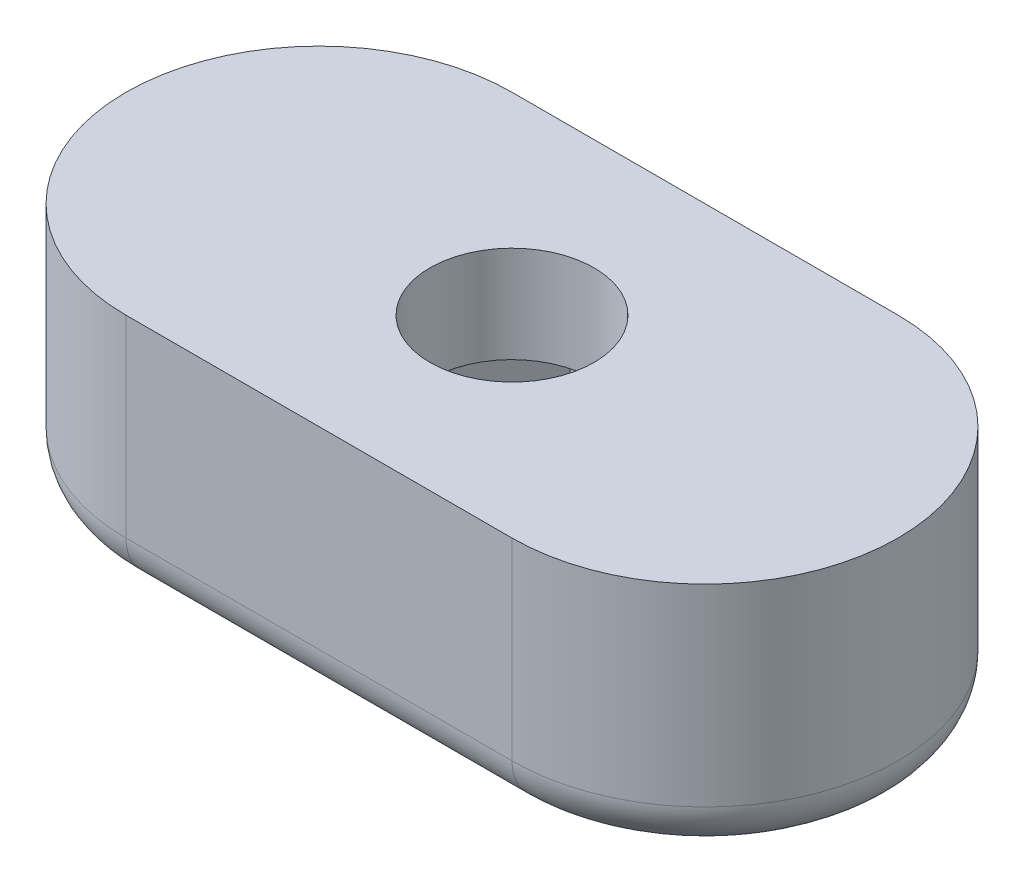
ISO-10303-21;
HEADER;
FILE_DESCRIPTION(('STEP AP214'),'2;1');
FILE_NAME('part.step','',(''),(''),'','','');
FILE_SCHEMA(('AUTOMOTIVE_DESIGN { 1 0 10303 214 1 1 1 1 }'));
ENDSEC;
DATA;
#1=APPLICATION_CONTEXT('core data for automotive mechanical design processes');
#2=APPLICATION_PROTOCOL_DEFINITION('international standard','automotive_design',2000,#1);
#3=PRODUCT_CONTEXT('',#1,'mechanical');
#4=PRODUCT('Part','Part','',(#3));
#5=PRODUCT_RELATED_PRODUCT_CATEGORY('part','',(#4));
#6=PRODUCT_DEFINITION_FORMATION('','',#4);
#7=PRODUCT_DEFINITION_CONTEXT('part definition',#1,'design');
#8=PRODUCT_DEFINITION('design','',#6,#7);
#9=PRODUCT_DEFINITION_SHAPE('','',#8);
#10=(LENGTH_UNIT() NAMED_UNIT(*) SI_UNIT(.MILLI.,.METRE.));
#11=(NAMED_UNIT(*) PLANE_ANGLE_UNIT() SI_UNIT($,.RADIAN.));
#12=(NAMED_UNIT(*) SI_UNIT($,.STERADIAN.) SOLID_ANGLE_UNIT());
#13=UNCERTAINTY_MEASURE_WITH_UNIT(LENGTH_MEASURE(1.E-05),#10,'distance_accuracy_value','');
#14=(GEOMETRIC_REPRESENTATION_CONTEXT(3) GLOBAL_UNCERTAINTY_ASSIGNED_CONTEXT((#13)) GLOBAL_UNIT_ASSIGNED_CONTEXT((#10,
#11,#12)) REPRESENTATION_CONTEXT('',''));
#15=CARTESIAN_POINT('',(0.,0.,0.));
#16=DIRECTION('',(0.,0.,1.));
#17=DIRECTION('',(1.,0.,0.));
#18=AXIS2_PLACEMENT_3D('',#15,#16,#17);
#19=CARTESIAN_POINT('',(-3.29089653438086,5.,0.));
#20=DIRECTION('',(0.86602540378444,0.,0.499999999999998));
#21=DIRECTION('',(0.499999999999998,0.,-0.86602540378444));
#22=AXIS2_PLACEMENT_3D('',#19,#20,#21);
#23=PLANE('',#22);
#24=DIRECTION('',(0.,-1.,0.));
#25=VECTOR('',#24,1.);
#26=CARTESIAN_POINT('',(-1.64544826719043,5.,-2.85));
#27=LINE('',#26,#25);
#28=CARTESIAN_POINT('',(-1.64544826719043,3.,-2.85));
#29=VERTEX_POINT('',#28);
#30=CARTESIAN_POINT('',(-1.64544826719043,0.,-2.85));
#31=VERTEX_POINT('',#30);
#32=EDGE_CURVE('E159',#29,#31,#27,.T.);
#33=ORIENTED_EDGE('',*,*,#32,.F.);
#34=DIRECTION('',(-0.499999999999998,0.,0.86602540378444));
#35=VECTOR('',#34,1.);
#36=CARTESIAN_POINT('',(-3.29089653438086,3.,0.));
#37=LINE('',#36,#35);
#38=CARTESIAN_POINT('',(-3.29089653438086,3.,0.));
#39=VERTEX_POINT('',#38);
#40=EDGE_CURVE('E138',#29,#39,#37,.T.);
#41=ORIENTED_EDGE('',*,*,#40,.T.);
#42=DIRECTION('',(0.,-1.,0.));
#43=VECTOR('',#42,1.);
#44=CARTESIAN_POINT('',(-3.29089653438086,5.,0.));
#45=LINE('',#44,#43);
#46=CARTESIAN_POINT('',(-3.29089653438086,0.,0.));
#47=VERTEX_POINT('',#46);
#48=EDGE_CURVE('E169',#39,#47,#45,.T.);
#49=ORIENTED_EDGE('',*,*,#48,.T.);
#50=DIRECTION('',(-0.499999999999998,0.,0.86602540378444));
#51=VECTOR('',#50,1.);
#52=CARTESIAN_POINT('',(-3.29089653438086,0.,0.));
#53=LINE('',#52,#51);
#54=EDGE_CURVE('E231',#31,#47,#53,.T.);
#55=ORIENTED_EDGE('',*,*,#54,.F.);
#56=EDGE_LOOP('',(#33,#41,#49,#55));
#57=FACE_BOUND('',#56,.T.);
#58=ADVANCED_FACE('F41',(#57),#23,.T.);
#59=CARTESIAN_POINT('',(-1.64544826719043,5.,2.85));
#60=DIRECTION('',(0.86602540378444,0.,-0.499999999999998));
#61=DIRECTION('',(-0.499999999999998,0.,-0.86602540378444));
#62=AXIS2_PLACEMENT_3D('',#59,#60,#61);
#63=PLANE('',#62);
#64=ORIENTED_EDGE('',*,*,#48,.F.);
#65=DIRECTION('',(0.499999999999998,0.,0.86602540378444));
#66=VECTOR('',#65,1.);
#67=CARTESIAN_POINT('',(-1.64544826719043,3.,2.85));
#68=LINE('',#67,#66);
#69=CARTESIAN_POINT('',(-1.64544826719043,3.,2.85));
#70=VERTEX_POINT('',#69);
#71=EDGE_CURVE('E227',#39,#70,#68,.T.);
#72=ORIENTED_EDGE('',*,*,#71,.T.);
#73=DIRECTION('',(0.,-1.,0.));
#74=VECTOR('',#73,1.);
#75=CARTESIAN_POINT('',(-1.64544826719043,5.,2.85));
#76=LINE('',#75,#74);
#77=CARTESIAN_POINT('',(-1.64544826719043,0.,2.85));
#78=VERTEX_POINT('',#77);
#79=EDGE_CURVE('E167',#70,#78,#76,.T.);
#80=ORIENTED_EDGE('',*,*,#79,.T.);
#81=DIRECTION('',(0.499999999999998,0.,0.86602540378444));
#82=VECTOR('',#81,1.);
#83=CARTESIAN_POINT('',(-1.64544826719043,0.,2.85));
#84=LINE('',#83,#82);
#85=EDGE_CURVE('E234',#47,#78,#84,.T.);
#86=ORIENTED_EDGE('',*,*,#85,.F.);
#87=EDGE_LOOP('',(#64,#72,#80,#86));
#88=FACE_BOUND('',#87,.T.);
#89=ADVANCED_FACE('F258',(#88),#63,.T.);
#90=CARTESIAN_POINT('',(1.64544826719043,5.,2.85));
#91=DIRECTION('',(0.,0.,-1.));
#92=DIRECTION('',(-1.,0.,0.));
#93=AXIS2_PLACEMENT_3D('',#90,#91,#92);
#94=PLANE('',#93);
#95=ORIENTED_EDGE('',*,*,#79,.F.);
#96=DIRECTION('',(1.,0.,0.));
#97=VECTOR('',#96,1.);
#98=CARTESIAN_POINT('',(1.64544826719043,3.,2.85));
#99=LINE('',#98,#97);
#100=CARTESIAN_POINT('',(1.64544826719043,3.,2.85));
#101=VERTEX_POINT('',#100);
#102=EDGE_CURVE('E224',#70,#101,#99,.T.);
#103=ORIENTED_EDGE('',*,*,#102,.T.);
#104=DIRECTION('',(0.,-1.,0.));
#105=VECTOR('',#104,1.);
#106=CARTESIAN_POINT('',(1.64544826719043,5.,2.85));
#107=LINE('',#106,#105);
#108=CARTESIAN_POINT('',(1.64544826719043,0.,2.85));
#109=VERTEX_POINT('',#108);
#110=EDGE_CURVE('E161',#101,#109,#107,.T.);
#111=ORIENTED_EDGE('',*,*,#110,.T.);
#112=DIRECTION('',(1.,0.,0.));
#113=VECTOR('',#112,1.);
#114=CARTESIAN_POINT('',(1.64544826719043,0.,2.85));
#115=LINE('',#114,#113);
#116=EDGE_CURVE('E237',#78,#109,#115,.T.);
#117=ORIENTED_EDGE('',*,*,#116,.F.);
#118=EDGE_LOOP('',(#95,#103,#111,#117));
#119=FACE_BOUND('',#118,.T.);
#120=ADVANCED_FACE('F254',(#119),#94,.T.);
#121=CARTESIAN_POINT('',(3.29089653438086,5.,0.));
#122=DIRECTION('',(-0.86602540378444,0.,-0.499999999999998));
#123=DIRECTION('',(-0.499999999999998,0.,0.86602540378444));
#124=AXIS2_PLACEMENT_3D('',#121,#122,#123);
#125=PLANE('',#124);
#126=ORIENTED_EDGE('',*,*,#110,.F.);
#127=DIRECTION('',(0.499999999999998,0.,-0.86602540378444));
#128=VECTOR('',#127,1.);
#129=CARTESIAN_POINT('',(3.29089653438086,3.,0.));
#130=LINE('',#129,#128);
#131=CARTESIAN_POINT('',(3.29089653438086,3.,0.));
#132=VERTEX_POINT('',#131);
#133=EDGE_CURVE('E152',#101,#132,#130,.T.);
#134=ORIENTED_EDGE('',*,*,#133,.T.);
#135=DIRECTION('',(0.,-1.,0.));
#136=VECTOR('',#135,1.);
#137=CARTESIAN_POINT('',(3.29089653438086,5.,0.));
#138=LINE('',#137,#136);
#139=CARTESIAN_POINT('',(3.29089653438086,0.,0.));
#140=VERTEX_POINT('',#139);
#141=EDGE_CURVE('E151',#132,#140,#138,.T.);
#142=ORIENTED_EDGE('',*,*,#141,.T.);
#143=DIRECTION('',(0.499999999999998,0.,-0.86602540378444));
#144=VECTOR('',#143,1.);
#145=CARTESIAN_POINT('',(3.29089653438086,0.,0.));
#146=LINE('',#145,#144);
#147=EDGE_CURVE('E240',#109,#140,#146,.T.);
#148=ORIENTED_EDGE('',*,*,#147,.F.);
#149=EDGE_LOOP('',(#126,#134,#142,#148));
#150=FACE_BOUND('',#149,.T.);
#151=ADVANCED_FACE('F251',(#150),#125,.T.);
#152=CARTESIAN_POINT('',(1.64544826719043,5.,-2.85));
#153=DIRECTION('',(-0.86602540378444,0.,0.499999999999998));
#154=DIRECTION('',(0.499999999999998,0.,0.86602540378444));
#155=AXIS2_PLACEMENT_3D('',#152,#153,#154);
#156=PLANE('',#155);
#157=ORIENTED_EDGE('',*,*,#141,.F.);
#158=DIRECTION('',(-0.499999999999998,0.,-0.86602540378444));
#159=VECTOR('',#158,1.);
#160=CARTESIAN_POINT('',(1.64544826719043,3.,-2.85));
#161=LINE('',#160,#159);
#162=CARTESIAN_POINT('',(1.64544826719043,3.,-2.85));
#163=VERTEX_POINT('',#162);
#164=EDGE_CURVE('E135',#132,#163,#161,.T.);
#165=ORIENTED_EDGE('',*,*,#164,.T.);
#166=DIRECTION('',(0.,-1.,0.));
#167=VECTOR('',#166,1.);
#168=CARTESIAN_POINT('',(1.64544826719043,5.,-2.85));
#169=LINE('',#168,#167);
#170=CARTESIAN_POINT('',(1.64544826719043,0.,-2.85));
#171=VERTEX_POINT('',#170);
#172=EDGE_CURVE('E149',#163,#171,#169,.T.);
#173=ORIENTED_EDGE('',*,*,#172,.T.);
#174=DIRECTION('',(-0.499999999999998,0.,-0.86602540378444));
#175=VECTOR('',#174,1.);
#176=CARTESIAN_POINT('',(1.64544826719043,0.,-2.85));
#177=LINE('',#176,#175);
#178=EDGE_CURVE('E243',#140,#171,#177,.T.);
#179=ORIENTED_EDGE('',*,*,#178,.F.);
#180=EDGE_LOOP('',(#157,#165,#173,#179));
#181=FACE_BOUND('',#180,.T.);
#182=ADVANCED_FACE('F147',(#181),#156,.T.);
#183=CARTESIAN_POINT('',(-1.64544826719043,5.,-2.85));
#184=DIRECTION('',(0.,0.,1.));
#185=DIRECTION('',(1.,0.,0.));
#186=AXIS2_PLACEMENT_3D('',#183,#184,#185);
#187=PLANE('',#186);
#188=ORIENTED_EDGE('',*,*,#172,.F.);
#189=DIRECTION('',(-1.,0.,0.));
#190=VECTOR('',#189,1.);
#191=CARTESIAN_POINT('',(-1.64544826719043,3.,-2.85));
#192=LINE('',#191,#190);
#193=EDGE_CURVE('E131',#163,#29,#192,.T.);
#194=ORIENTED_EDGE('',*,*,#193,.T.);
#195=ORIENTED_EDGE('',*,*,#32,.T.);
#196=DIRECTION('',(-1.,0.,0.));
#197=VECTOR('',#196,1.);
#198=CARTESIAN_POINT('',(-1.64544826719043,0.,-2.85));
#199=LINE('',#198,#197);
#200=EDGE_CURVE('E157',#171,#31,#199,.T.);
#201=ORIENTED_EDGE('',*,*,#200,.F.);
#202=EDGE_LOOP('',(#188,#194,#195,#201));
#203=FACE_BOUND('',#202,.T.);
#204=ADVANCED_FACE('F155',(#203),#187,.T.);
#205=CARTESIAN_POINT('',(-4.,5.,0.));
#206=DIRECTION('',(0.,1.,0.));
#207=DIRECTION('',(0.,0.,1.));
#208=AXIS2_PLACEMENT_3D('',#205,#206,#207);
#209=PLANE('',#208);
#210=CARTESIAN_POINT('',(-4.,5.,0.));
#211=DIRECTION('',(0.,1.,0.));
#212=DIRECTION('',(0.,0.,1.));
#213=AXIS2_PLACEMENT_3D('',#210,#211,#212);
#214=CIRCLE('',#213,4.);
#215=CARTESIAN_POINT('',(-4.,5.,-4.));
#216=VERTEX_POINT('',#215);
#217=CARTESIAN_POINT('',(-4.,5.,4.));
#218=VERTEX_POINT('',#217);
#219=EDGE_CURVE('E171',#216,#218,#214,.T.);
#220=ORIENTED_EDGE('',*,*,#219,.T.);
#221=DIRECTION('',(1.,0.,0.));
#222=VECTOR('',#221,1.);
#223=CARTESIAN_POINT('',(-4.,5.,4.));
#224=LINE('',#223,#222);
#225=CARTESIAN_POINT('',(4.,5.,4.));
#226=VERTEX_POINT('',#225);
#227=EDGE_CURVE('E174',#218,#226,#224,.T.);
#228=ORIENTED_EDGE('',*,*,#227,.T.);
#229=CARTESIAN_POINT('',(4.,5.,0.));
#230=DIRECTION('',(0.,1.,0.));
#231=DIRECTION('',(0.,0.,1.));
#232=AXIS2_PLACEMENT_3D('',#229,#230,#231);
#233=CIRCLE('',#232,4.);
#234=CARTESIAN_POINT('',(4.,5.,-4.));
#235=VERTEX_POINT('',#234);
#236=EDGE_CURVE('E176',#226,#235,#233,.T.);
#237=ORIENTED_EDGE('',*,*,#236,.T.);
#238=DIRECTION('',(-1.,0.,0.));
#239=VECTOR('',#238,1.);
#240=CARTESIAN_POINT('',(-4.,5.,-4.));
#241=LINE('',#240,#239);
#242=EDGE_CURVE('E178',#235,#216,#241,.T.);
#243=ORIENTED_EDGE('',*,*,#242,.T.);
#244=EDGE_LOOP('',(#220,#228,#237,#243));
#245=FACE_BOUND('',#244,.T.);
#246=CARTESIAN_POINT('',(0.,5.,0.));
#247=DIRECTION('',(0.,1.,0.));
#248=DIRECTION('',(0.,0.,1.));
#249=AXIS2_PLACEMENT_3D('',#246,#247,#248);
#250=CIRCLE('',#249,1.7);
#251=CARTESIAN_POINT('',(0.,5.,1.7));
#252=VERTEX_POINT('',#251);
#253=EDGE_CURVE('E211',#252,#252,#250,.T.);
#254=ORIENTED_EDGE('',*,*,#253,.F.);
#255=EDGE_LOOP('',(#254));
#256=FACE_BOUND('',#255,.T.);
#257=ADVANCED_FACE('F268',(#245,#256),#209,.T.);
#258=CARTESIAN_POINT('',(-4.,0.,0.));
#259=DIRECTION('',(0.,1.,0.));
#260=DIRECTION('',(0.,0.,1.));
#261=AXIS2_PLACEMENT_3D('',#258,#259,#260);
#262=PLANE('',#261);
#263=CARTESIAN_POINT('',(-4.,0.,0.));
#264=DIRECTION('',(0.,1.,0.));
#265=DIRECTION('',(0.,0.,1.));
#266=AXIS2_PLACEMENT_3D('',#263,#264,#265);
#267=CIRCLE('',#266,3.);
#268=CARTESIAN_POINT('',(-4.,0.,3.));
#269=VERTEX_POINT('',#268);
#270=CARTESIAN_POINT('',(-4.,0.,-3.));
#271=VERTEX_POINT('',#270);
#272=EDGE_CURVE('E190',#269,#271,#267,.F.);
#273=ORIENTED_EDGE('',*,*,#272,.T.);
#274=DIRECTION('',(-1.,0.,0.));
#275=VECTOR('',#274,1.);
#276=CARTESIAN_POINT('',(-4.,0.,-3.));
#277=LINE('',#276,#275);
#278=CARTESIAN_POINT('',(4.,0.,-3.));
#279=VERTEX_POINT('',#278);
#280=EDGE_CURVE('E196',#271,#279,#277,.F.);
#281=ORIENTED_EDGE('',*,*,#280,.T.);
#282=CARTESIAN_POINT('',(4.,0.,0.));
#283=DIRECTION('',(0.,1.,0.));
#284=DIRECTION('',(0.,0.,1.));
#285=AXIS2_PLACEMENT_3D('',#282,#283,#284);
#286=CIRCLE('',#285,3.);
#287=CARTESIAN_POINT('',(4.,0.,3.));
#288=VERTEX_POINT('',#287);
#289=EDGE_CURVE('E194',#279,#288,#286,.F.);
#290=ORIENTED_EDGE('',*,*,#289,.T.);
#291=DIRECTION('',(1.,0.,0.));
#292=VECTOR('',#291,1.);
#293=CARTESIAN_POINT('',(-4.,0.,3.));
#294=LINE('',#293,#292);
#295=EDGE_CURVE('E192',#288,#269,#294,.F.);
#296=ORIENTED_EDGE('',*,*,#295,.T.);
#297=EDGE_LOOP('',(#273,#281,#290,#296));
#298=FACE_BOUND('',#297,.T.);
#299=ORIENTED_EDGE('',*,*,#54,.T.);
#300=ORIENTED_EDGE('',*,*,#85,.T.);
#301=ORIENTED_EDGE('',*,*,#116,.T.);
#302=ORIENTED_EDGE('',*,*,#147,.T.);
#303=ORIENTED_EDGE('',*,*,#178,.T.);
#304=ORIENTED_EDGE('',*,*,#200,.T.);
#305=EDGE_LOOP('',(#299,#300,#301,#302,#303,#304));
#306=FACE_BOUND('',#305,.T.);
#307=ADVANCED_FACE('F245',(#298,#306),#262,.F.);
#308=CARTESIAN_POINT('',(-4.,5.,0.));
#309=DIRECTION('',(0.,-1.,0.));
#310=DIRECTION('',(0.,0.,-1.));
#311=AXIS2_PLACEMENT_3D('',#308,#309,#310);
#312=CYLINDRICAL_SURFACE('',#311,4.);
#313=DIRECTION('',(0.,-1.,0.));
#314=VECTOR('',#313,1.);
#315=CARTESIAN_POINT('',(-4.,5.,-4.));
#316=LINE('',#315,#314);
#317=CARTESIAN_POINT('',(-4.,1.,-4.));
#318=VERTEX_POINT('',#317);
#319=EDGE_CURVE('E180',#216,#318,#316,.T.);
#320=ORIENTED_EDGE('',*,*,#319,.T.);
#321=CARTESIAN_POINT('',(-4.,1.,0.));
#322=DIRECTION('',(0.,1.,0.));
#323=DIRECTION('',(0.,0.,1.));
#324=AXIS2_PLACEMENT_3D('',#321,#322,#323);
#325=CIRCLE('',#324,4.);
#326=CARTESIAN_POINT('',(-4.,1.,4.));
#327=VERTEX_POINT('',#326);
#328=EDGE_CURVE('E12',#318,#327,#325,.T.);
#329=ORIENTED_EDGE('',*,*,#328,.T.);
#330=DIRECTION('',(0.,-1.,0.));
#331=VECTOR('',#330,1.);
#332=CARTESIAN_POINT('',(-4.,5.,4.));
#333=LINE('',#332,#331);
#334=EDGE_CURVE('E143',#218,#327,#333,.T.);
#335=ORIENTED_EDGE('',*,*,#334,.F.);
#336=ORIENTED_EDGE('',*,*,#219,.F.);
#337=EDGE_LOOP('',(#320,#329,#335,#336));
#338=FACE_BOUND('',#337,.T.);
#339=ADVANCED_FACE('F274',(#338),#312,.T.);
#340=CARTESIAN_POINT('',(-4.,5.,4.));
#341=DIRECTION('',(0.,0.,-1.));
#342=DIRECTION('',(-1.,0.,0.));
#343=AXIS2_PLACEMENT_3D('',#340,#341,#342);
#344=PLANE('',#343);
#345=ORIENTED_EDGE('',*,*,#334,.T.);
#346=DIRECTION('',(1.,0.,0.));
#347=VECTOR('',#346,1.);
#348=CARTESIAN_POINT('',(-4.,1.,4.));
#349=LINE('',#348,#347);
#350=CARTESIAN_POINT('',(4.,1.,4.));
#351=VERTEX_POINT('',#350);
#352=EDGE_CURVE('E50',#327,#351,#349,.T.);
#353=ORIENTED_EDGE('',*,*,#352,.T.);
#354=DIRECTION('',(0.,-1.,0.));
#355=VECTOR('',#354,1.);
#356=CARTESIAN_POINT('',(4.,5.,4.));
#357=LINE('',#356,#355);
#358=EDGE_CURVE('E185',#226,#351,#357,.T.);
#359=ORIENTED_EDGE('',*,*,#358,.F.);
#360=ORIENTED_EDGE('',*,*,#227,.F.);
#361=EDGE_LOOP('',(#345,#353,#359,#360));
#362=FACE_BOUND('',#361,.T.);
#363=ADVANCED_FACE('F284',(#362),#344,.F.);
#364=CARTESIAN_POINT('',(4.,5.,0.));
#365=DIRECTION('',(0.,-1.,0.));
#366=DIRECTION('',(0.,0.,-1.));
#367=AXIS2_PLACEMENT_3D('',#364,#365,#366);
#368=CYLINDRICAL_SURFACE('',#367,4.);
#369=ORIENTED_EDGE('',*,*,#358,.T.);
#370=CARTESIAN_POINT('',(4.,1.,0.));
#371=DIRECTION('',(0.,1.,0.));
#372=DIRECTION('',(0.,0.,1.));
#373=AXIS2_PLACEMENT_3D('',#370,#371,#372);
#374=CIRCLE('',#373,4.);
#375=CARTESIAN_POINT('',(4.,1.,-4.));
#376=VERTEX_POINT('',#375);
#377=EDGE_CURVE('E199',#351,#376,#374,.T.);
#378=ORIENTED_EDGE('',*,*,#377,.T.);
#379=DIRECTION('',(0.,-1.,0.));
#380=VECTOR('',#379,1.);
#381=CARTESIAN_POINT('',(4.,5.,-4.));
#382=LINE('',#381,#380);
#383=EDGE_CURVE('E182',#235,#376,#382,.T.);
#384=ORIENTED_EDGE('',*,*,#383,.F.);
#385=ORIENTED_EDGE('',*,*,#236,.F.);
#386=EDGE_LOOP('',(#369,#378,#384,#385));
#387=FACE_BOUND('',#386,.T.);
#388=ADVANCED_FACE('F280',(#387),#368,.T.);
#389=CARTESIAN_POINT('',(-4.,5.,-4.));
#390=DIRECTION('',(0.,0.,1.));
#391=DIRECTION('',(1.,0.,0.));
#392=AXIS2_PLACEMENT_3D('',#389,#390,#391);
#393=PLANE('',#392);
#394=ORIENTED_EDGE('',*,*,#383,.T.);
#395=DIRECTION('',(-1.,0.,0.));
#396=VECTOR('',#395,1.);
#397=CARTESIAN_POINT('',(-4.,1.,-4.));
#398=LINE('',#397,#396);
#399=EDGE_CURVE('E142',#376,#318,#398,.T.);
#400=ORIENTED_EDGE('',*,*,#399,.T.);
#401=ORIENTED_EDGE('',*,*,#319,.F.);
#402=ORIENTED_EDGE('',*,*,#242,.F.);
#403=EDGE_LOOP('',(#394,#400,#401,#402));
#404=FACE_BOUND('',#403,.T.);
#405=ADVANCED_FACE('F276',(#404),#393,.F.);
#406=CARTESIAN_POINT('',(0.,-17.8885438199983,0.));
#407=DIRECTION('',(0.,1.,0.));
#408=DIRECTION('',(0.,0.,1.));
#409=AXIS2_PLACEMENT_3D('',#406,#407,#408);
#410=CYLINDRICAL_SURFACE('',#409,1.7);
#411=CARTESIAN_POINT('',(0.,3.,0.));
#412=DIRECTION('',(0.,1.,0.));
#413=DIRECTION('',(0.,0.,1.));
#414=AXIS2_PLACEMENT_3D('',#411,#412,#413);
#415=CIRCLE('',#414,1.7);
#416=CARTESIAN_POINT('',(0.,3.,1.7));
#417=VERTEX_POINT('',#416);
#418=EDGE_CURVE('E153',#417,#417,#415,.F.);
#419=ORIENTED_EDGE('',*,*,#418,.T.);
#420=EDGE_LOOP('',(#419));
#421=FACE_BOUND('',#420,.T.);
#422=ORIENTED_EDGE('',*,*,#253,.T.);
#423=EDGE_LOOP('',(#422));
#424=FACE_BOUND('',#423,.T.);
#425=ADVANCED_FACE('F279',(#421,#424),#410,.F.);
#426=CARTESIAN_POINT('',(-4.,3.,0.));
#427=DIRECTION('',(0.,1.,0.));
#428=DIRECTION('',(0.,0.,1.));
#429=AXIS2_PLACEMENT_3D('',#426,#427,#428);
#430=PLANE('',#429);
#431=ORIENTED_EDGE('',*,*,#40,.F.);
#432=ORIENTED_EDGE('',*,*,#193,.F.);
#433=ORIENTED_EDGE('',*,*,#164,.F.);
#434=ORIENTED_EDGE('',*,*,#133,.F.);
#435=ORIENTED_EDGE('',*,*,#102,.F.);
#436=ORIENTED_EDGE('',*,*,#71,.F.);
#437=EDGE_LOOP('',(#431,#432,#433,#434,#435,#436));
#438=FACE_BOUND('',#437,.T.);
#439=ORIENTED_EDGE('',*,*,#418,.F.);
#440=EDGE_LOOP('',(#439));
#441=FACE_BOUND('',#440,.T.);
#442=ADVANCED_FACE('F133',(#438,#441),#430,.F.);
#443=CARTESIAN_POINT('',(-4.,1.,3.));
#444=DIRECTION('',(1.,0.,0.));
#445=DIRECTION('',(0.,0.,-1.));
#446=AXIS2_PLACEMENT_3D('',#443,#444,#445);
#447=CYLINDRICAL_SURFACE('',#446,1.);
#448=CARTESIAN_POINT('',(-4.,1.,3.));
#449=DIRECTION('',(-1.,0.,0.));
#450=DIRECTION('',(0.,0.,1.));
#451=AXIS2_PLACEMENT_3D('',#448,#449,#450);
#452=CIRCLE('',#451,1.);
#453=EDGE_CURVE('E205',#269,#327,#452,.T.);
#454=ORIENTED_EDGE('',*,*,#453,.F.);
#455=ORIENTED_EDGE('',*,*,#295,.F.);
#456=CARTESIAN_POINT('',(4.,1.,3.));
#457=DIRECTION('',(1.,0.,0.));
#458=DIRECTION('',(0.,0.,-1.));
#459=AXIS2_PLACEMENT_3D('',#456,#457,#458);
#460=CIRCLE('',#459,1.);
#461=EDGE_CURVE('E45',#351,#288,#460,.T.);
#462=ORIENTED_EDGE('',*,*,#461,.F.);
#463=ORIENTED_EDGE('',*,*,#352,.F.);
#464=EDGE_LOOP('',(#454,#455,#462,#463));
#465=FACE_BOUND('',#464,.T.);
#466=ADVANCED_FACE('F43',(#465),#447,.T.);
#467=CARTESIAN_POINT('',(4.,1.,0.));
#468=DIRECTION('',(0.,1.,0.));
#469=DIRECTION('',(0.,0.,1.));
#470=AXIS2_PLACEMENT_3D('',#467,#468,#469);
#471=TOROIDAL_SURFACE('',#470,3.,1.);
#472=ORIENTED_EDGE('',*,*,#461,.T.);
#473=ORIENTED_EDGE('',*,*,#289,.F.);
#474=CARTESIAN_POINT('',(4.,1.,-3.));
#475=DIRECTION('',(-1.,0.,0.));
#476=DIRECTION('',(0.,0.,1.));
#477=AXIS2_PLACEMENT_3D('',#474,#475,#476);
#478=CIRCLE('',#477,1.);
#479=EDGE_CURVE('E204',#376,#279,#478,.T.);
#480=ORIENTED_EDGE('',*,*,#479,.F.);
#481=ORIENTED_EDGE('',*,*,#377,.F.);
#482=EDGE_LOOP('',(#472,#473,#480,#481));
#483=FACE_BOUND('',#482,.T.);
#484=ADVANCED_FACE('F296',(#483),#471,.T.);
#485=CARTESIAN_POINT('',(-4.,1.,0.));
#486=DIRECTION('',(0.,1.,0.));
#487=DIRECTION('',(0.,0.,1.));
#488=AXIS2_PLACEMENT_3D('',#485,#486,#487);
#489=TOROIDAL_SURFACE('',#488,3.,1.);
#490=ORIENTED_EDGE('',*,*,#453,.T.);
#491=ORIENTED_EDGE('',*,*,#328,.F.);
#492=CARTESIAN_POINT('',(-4.,1.,-3.));
#493=DIRECTION('',(1.,0.,0.));
#494=DIRECTION('',(0.,0.,-1.));
#495=AXIS2_PLACEMENT_3D('',#492,#493,#494);
#496=CIRCLE('',#495,1.);
#497=EDGE_CURVE('E202',#271,#318,#496,.T.);
#498=ORIENTED_EDGE('',*,*,#497,.F.);
#499=ORIENTED_EDGE('',*,*,#272,.F.);
#500=EDGE_LOOP('',(#490,#491,#498,#499));
#501=FACE_BOUND('',#500,.T.);
#502=ADVANCED_FACE('F293',(#501),#489,.T.);
#503=CARTESIAN_POINT('',(-4.,1.,-3.));
#504=DIRECTION('',(-1.,0.,0.));
#505=DIRECTION('',(0.,0.,1.));
#506=AXIS2_PLACEMENT_3D('',#503,#504,#505);
#507=CYLINDRICAL_SURFACE('',#506,1.);
#508=ORIENTED_EDGE('',*,*,#479,.T.);
#509=ORIENTED_EDGE('',*,*,#280,.F.);
#510=ORIENTED_EDGE('',*,*,#497,.T.);
#511=ORIENTED_EDGE('',*,*,#399,.F.);
#512=EDGE_LOOP('',(#508,#509,#510,#511));
#513=FACE_BOUND('',#512,.T.);
#514=ADVANCED_FACE('F290',(#513),#507,.T.);
#515=CLOSED_SHELL('',(#58,#89,#120,#151,#182,#204,#257,#307,#339,#363,#388,#405,#425,#442,#466,
#484,#502,#514));
#516=MANIFOLD_SOLID_BREP('B2',#515);
#517=ADVANCED_BREP_SHAPE_REPRESENTATION('',(#18,#516),#14);
#518=SHAPE_DEFINITION_REPRESENTATION(#9,#517);
ENDSEC;
END-ISO-10303-21;
